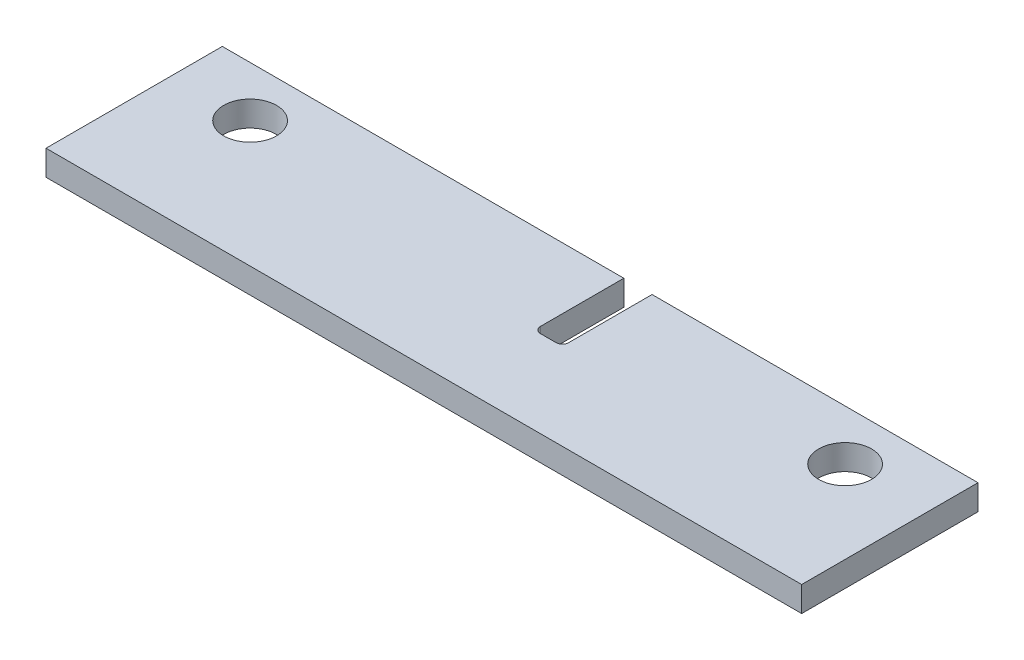
ISO-10303-21;
HEADER;
FILE_DESCRIPTION(('STEP AP214'),'2;1');
FILE_NAME('part.step','',(''),(''),'','','');
FILE_SCHEMA(('AUTOMOTIVE_DESIGN { 1 0 10303 214 1 1 1 1 }'));
ENDSEC;
DATA;
#1=APPLICATION_CONTEXT('core data for automotive mechanical design processes');
#2=APPLICATION_PROTOCOL_DEFINITION('international standard','automotive_design',2000,#1);
#3=PRODUCT_CONTEXT('',#1,'mechanical');
#4=PRODUCT('Part','Part','',(#3));
#5=PRODUCT_RELATED_PRODUCT_CATEGORY('part','',(#4));
#6=PRODUCT_DEFINITION_FORMATION('','',#4);
#7=PRODUCT_DEFINITION_CONTEXT('part definition',#1,'design');
#8=PRODUCT_DEFINITION('design','',#6,#7);
#9=PRODUCT_DEFINITION_SHAPE('','',#8);
#10=(LENGTH_UNIT() NAMED_UNIT(*) SI_UNIT(.MILLI.,.METRE.));
#11=(NAMED_UNIT(*) PLANE_ANGLE_UNIT() SI_UNIT($,.RADIAN.));
#12=(NAMED_UNIT(*) SI_UNIT($,.STERADIAN.) SOLID_ANGLE_UNIT());
#13=UNCERTAINTY_MEASURE_WITH_UNIT(LENGTH_MEASURE(1.E-05),#10,'distance_accuracy_value','');
#14=(GEOMETRIC_REPRESENTATION_CONTEXT(3) GLOBAL_UNCERTAINTY_ASSIGNED_CONTEXT((#13)) GLOBAL_UNIT_ASSIGNED_CONTEXT((#10,
#11,#12)) REPRESENTATION_CONTEXT('',''));
#15=CARTESIAN_POINT('',(0.,0.,0.));
#16=DIRECTION('',(0.,0.,1.));
#17=DIRECTION('',(1.,0.,0.));
#18=AXIS2_PLACEMENT_3D('',#15,#16,#17);
#19=CARTESIAN_POINT('',(0.,0.,249.6));
#20=DIRECTION('',(0.,0.,1.));
#21=DIRECTION('',(1.,0.,0.));
#22=AXIS2_PLACEMENT_3D('',#19,#20,#21);
#23=PLANE('',#22);
#24=DIRECTION('',(-1.,0.,0.));
#25=VECTOR('',#24,1.);
#26=CARTESIAN_POINT('',(2260.6,65.,249.6));
#27=LINE('',#26,#25);
#28=CARTESIAN_POINT('',(2463.038,65.,249.6));
#29=VERTEX_POINT('',#28);
#30=CARTESIAN_POINT('',(2260.6,65.,249.6));
#31=VERTEX_POINT('',#30);
#32=EDGE_CURVE('E117',#29,#31,#27,.T.);
#33=ORIENTED_EDGE('',*,*,#32,.F.);
#34=DIRECTION('',(0.,1.,0.));
#35=VECTOR('',#34,1.);
#36=CARTESIAN_POINT('',(2463.038,52.3,249.6));
#37=LINE('',#36,#35);
#38=CARTESIAN_POINT('',(2463.038,52.3,249.6));
#39=VERTEX_POINT('',#38);
#40=EDGE_CURVE('E171',#39,#29,#37,.T.);
#41=ORIENTED_EDGE('',*,*,#40,.F.);
#42=DIRECTION('',(1.,0.,0.));
#43=VECTOR('',#42,1.);
#44=CARTESIAN_POINT('',(2260.6,52.3,249.6));
#45=LINE('',#44,#43);
#46=CARTESIAN_POINT('',(2260.6,52.3,249.6));
#47=VERTEX_POINT('',#46);
#48=EDGE_CURVE('E140',#47,#39,#45,.T.);
#49=ORIENTED_EDGE('',*,*,#48,.F.);
#50=DIRECTION('',(0.,-1.,0.));
#51=VECTOR('',#50,1.);
#52=CARTESIAN_POINT('',(2260.6,65.,249.6));
#53=LINE('',#52,#51);
#54=EDGE_CURVE('E134',#31,#47,#53,.T.);
#55=ORIENTED_EDGE('',*,*,#54,.F.);
#56=EDGE_LOOP('',(#33,#41,#49,#55));
#57=FACE_BOUND('',#56,.T.);
#58=ADVANCED_FACE('F43',(#57),#23,.F.);
#59=CARTESIAN_POINT('',(2260.6,65.,249.6));
#60=DIRECTION('',(-1.,0.,0.));
#61=DIRECTION('',(0.,0.,1.));
#62=AXIS2_PLACEMENT_3D('',#59,#60,#61);
#63=PLANE('',#62);
#64=DIRECTION('',(0.,0.,1.));
#65=VECTOR('',#64,1.);
#66=CARTESIAN_POINT('',(2260.6,52.3,249.6));
#67=LINE('',#66,#65);
#68=CARTESIAN_POINT('',(2260.6,52.3,338.5));
#69=VERTEX_POINT('',#68);
#70=EDGE_CURVE('E142',#47,#69,#67,.T.);
#71=ORIENTED_EDGE('',*,*,#70,.T.);
#72=DIRECTION('',(0.,-1.,0.));
#73=VECTOR('',#72,1.);
#74=CARTESIAN_POINT('',(2260.6,65.,338.5));
#75=LINE('',#74,#73);
#76=CARTESIAN_POINT('',(2260.6,65.,338.5));
#77=VERTEX_POINT('',#76);
#78=EDGE_CURVE('E136',#77,#69,#75,.T.);
#79=ORIENTED_EDGE('',*,*,#78,.F.);
#80=DIRECTION('',(0.,0.,1.));
#81=VECTOR('',#80,1.);
#82=CARTESIAN_POINT('',(2260.6,65.,249.6));
#83=LINE('',#82,#81);
#84=EDGE_CURVE('E121',#31,#77,#83,.T.);
#85=ORIENTED_EDGE('',*,*,#84,.F.);
#86=ORIENTED_EDGE('',*,*,#54,.T.);
#87=EDGE_LOOP('',(#71,#79,#85,#86));
#88=FACE_BOUND('',#87,.T.);
#89=ADVANCED_FACE('F133',(#88),#63,.T.);
#90=CARTESIAN_POINT('',(2260.6,65.,249.6));
#91=DIRECTION('',(0.,1.,0.));
#92=DIRECTION('',(0.,0.,1.));
#93=AXIS2_PLACEMENT_3D('',#90,#91,#92);
#94=PLANE('',#93);
#95=CARTESIAN_POINT('',(2599.99999999996,65.,275.));
#96=DIRECTION('',(0.,1.,0.));
#97=DIRECTION('',(0.,0.,1.));
#98=AXIS2_PLACEMENT_3D('',#95,#96,#97);
#99=CIRCLE('',#98,13.3349999999999);
#100=CARTESIAN_POINT('',(2599.99999999996,64.9999999999999,261.665));
#101=VERTEX_POINT('',#100);
#102=EDGE_CURVE('E141',#101,#101,#99,.F.);
#103=ORIENTED_EDGE('',*,*,#102,.T.);
#104=EDGE_LOOP('',(#103));
#105=FACE_BOUND('',#104,.T.);
#106=CARTESIAN_POINT('',(2299.99999999996,65.,275.));
#107=DIRECTION('',(0.,1.,0.));
#108=DIRECTION('',(0.,0.,1.));
#109=AXIS2_PLACEMENT_3D('',#106,#107,#108);
#110=CIRCLE('',#109,13.3349999999999);
#111=CARTESIAN_POINT('',(2299.99999999996,65.,261.665));
#112=VERTEX_POINT('',#111);
#113=EDGE_CURVE('E127',#112,#112,#110,.F.);
#114=ORIENTED_EDGE('',*,*,#113,.T.);
#115=EDGE_LOOP('',(#114));
#116=FACE_BOUND('',#115,.T.);
#117=DIRECTION('',(0.,0.,1.));
#118=VECTOR('',#117,1.);
#119=CARTESIAN_POINT('',(2463.038,65.,249.6));
#120=LINE('',#119,#118);
#121=CARTESIAN_POINT('',(2463.038,65.,291.637));
#122=VERTEX_POINT('',#121);
#123=EDGE_CURVE('E123',#29,#122,#120,.T.);
#124=ORIENTED_EDGE('',*,*,#123,.F.);
#125=ORIENTED_EDGE('',*,*,#32,.T.);
#126=ORIENTED_EDGE('',*,*,#84,.T.);
#127=DIRECTION('',(-1.,0.,0.));
#128=VECTOR('',#127,1.);
#129=CARTESIAN_POINT('',(2260.6,65.,338.5));
#130=LINE('',#129,#128);
#131=CARTESIAN_POINT('',(2641.6,65.,338.5));
#132=VERTEX_POINT('',#131);
#133=EDGE_CURVE('E150',#132,#77,#130,.T.);
#134=ORIENTED_EDGE('',*,*,#133,.F.);
#135=DIRECTION('',(0.,0.,1.));
#136=VECTOR('',#135,1.);
#137=CARTESIAN_POINT('',(2641.6,65.,249.6));
#138=LINE('',#137,#136);
#139=CARTESIAN_POINT('',(2641.6,65.,249.6));
#140=VERTEX_POINT('',#139);
#141=EDGE_CURVE('E256',#140,#132,#138,.T.);
#142=ORIENTED_EDGE('',*,*,#141,.F.);
#143=CARTESIAN_POINT('',(2477.262,65.,249.6));
#144=VERTEX_POINT('',#143);
#145=EDGE_CURVE('E129',#140,#144,#27,.T.);
#146=ORIENTED_EDGE('',*,*,#145,.T.);
#147=DIRECTION('',(0.,0.,-1.));
#148=VECTOR('',#147,1.);
#149=CARTESIAN_POINT('',(2477.262,65.,249.6));
#150=LINE('',#149,#148);
#151=CARTESIAN_POINT('',(2477.262,65.,291.637));
#152=VERTEX_POINT('',#151);
#153=EDGE_CURVE('E173',#152,#144,#150,.T.);
#154=ORIENTED_EDGE('',*,*,#153,.F.);
#155=CARTESIAN_POINT('',(2474.087,65.,291.637));
#156=DIRECTION('',(0.,1.,0.));
#157=DIRECTION('',(0.,0.,1.));
#158=AXIS2_PLACEMENT_3D('',#155,#156,#157);
#159=CIRCLE('',#158,3.175);
#160=CARTESIAN_POINT('',(2474.087,65.,294.812));
#161=VERTEX_POINT('',#160);
#162=EDGE_CURVE('E196',#152,#161,#159,.F.);
#163=ORIENTED_EDGE('',*,*,#162,.T.);
#164=DIRECTION('',(1.,0.,0.));
#165=VECTOR('',#164,1.);
#166=CARTESIAN_POINT('',(2260.6,65.,294.812));
#167=LINE('',#166,#165);
#168=CARTESIAN_POINT('',(2466.213,65.,294.812));
#169=VERTEX_POINT('',#168);
#170=EDGE_CURVE('E184',#169,#161,#167,.T.);
#171=ORIENTED_EDGE('',*,*,#170,.F.);
#172=CARTESIAN_POINT('',(2466.213,65.,291.637));
#173=DIRECTION('',(0.,1.,0.));
#174=DIRECTION('',(0.,0.,1.));
#175=AXIS2_PLACEMENT_3D('',#172,#173,#174);
#176=CIRCLE('',#175,3.175);
#177=EDGE_CURVE('E51',#169,#122,#176,.F.);
#178=ORIENTED_EDGE('',*,*,#177,.T.);
#179=EDGE_LOOP('',(#124,#125,#126,#134,#142,#146,#154,#163,#171,#178));
#180=FACE_BOUND('',#179,.T.);
#181=ADVANCED_FACE('F119',(#105,#116,#180),#94,.T.);
#182=CARTESIAN_POINT('',(2641.6,65.,249.6));
#183=DIRECTION('',(1.,0.,0.));
#184=DIRECTION('',(0.,0.,-1.));
#185=AXIS2_PLACEMENT_3D('',#182,#183,#184);
#186=PLANE('',#185);
#187=ORIENTED_EDGE('',*,*,#141,.T.);
#188=DIRECTION('',(0.,1.,0.));
#189=VECTOR('',#188,1.);
#190=CARTESIAN_POINT('',(2641.6,65.,338.5));
#191=LINE('',#190,#189);
#192=CARTESIAN_POINT('',(2641.6,52.3,338.5));
#193=VERTEX_POINT('',#192);
#194=EDGE_CURVE('E152',#193,#132,#191,.T.);
#195=ORIENTED_EDGE('',*,*,#194,.F.);
#196=DIRECTION('',(0.,0.,1.));
#197=VECTOR('',#196,1.);
#198=CARTESIAN_POINT('',(2641.6,52.3,249.6));
#199=LINE('',#198,#197);
#200=CARTESIAN_POINT('',(2641.6,52.3,249.6));
#201=VERTEX_POINT('',#200);
#202=EDGE_CURVE('E252',#201,#193,#199,.T.);
#203=ORIENTED_EDGE('',*,*,#202,.F.);
#204=DIRECTION('',(0.,1.,0.));
#205=VECTOR('',#204,1.);
#206=CARTESIAN_POINT('',(2641.6,65.,249.6));
#207=LINE('',#206,#205);
#208=EDGE_CURVE('E164',#201,#140,#207,.T.);
#209=ORIENTED_EDGE('',*,*,#208,.T.);
#210=EDGE_LOOP('',(#187,#195,#203,#209));
#211=FACE_BOUND('',#210,.T.);
#212=ADVANCED_FACE('F245',(#211),#186,.T.);
#213=CARTESIAN_POINT('',(2260.6,52.3,249.6));
#214=DIRECTION('',(0.,-1.,0.));
#215=DIRECTION('',(0.,0.,-1.));
#216=AXIS2_PLACEMENT_3D('',#213,#214,#215);
#217=PLANE('',#216);
#218=CARTESIAN_POINT('',(2599.99999999996,52.3,275.));
#219=DIRECTION('',(0.,-1.,0.));
#220=DIRECTION('',(0.,0.,-1.));
#221=AXIS2_PLACEMENT_3D('',#218,#219,#220);
#222=CIRCLE('',#221,13.3349999999999);
#223=CARTESIAN_POINT('',(2599.99999999996,52.3,261.665));
#224=VERTEX_POINT('',#223);
#225=EDGE_CURVE('E160',#224,#224,#222,.F.);
#226=ORIENTED_EDGE('',*,*,#225,.T.);
#227=EDGE_LOOP('',(#226));
#228=FACE_BOUND('',#227,.T.);
#229=CARTESIAN_POINT('',(2299.99999999996,52.3,275.));
#230=DIRECTION('',(0.,-1.,0.));
#231=DIRECTION('',(0.,0.,-1.));
#232=AXIS2_PLACEMENT_3D('',#229,#230,#231);
#233=CIRCLE('',#232,13.3349999999999);
#234=CARTESIAN_POINT('',(2299.99999999996,52.3,261.665));
#235=VERTEX_POINT('',#234);
#236=EDGE_CURVE('E163',#235,#235,#233,.F.);
#237=ORIENTED_EDGE('',*,*,#236,.T.);
#238=EDGE_LOOP('',(#237));
#239=FACE_BOUND('',#238,.T.);
#240=DIRECTION('',(0.,0.,1.));
#241=VECTOR('',#240,1.);
#242=CARTESIAN_POINT('',(2463.038,52.3,249.6));
#243=LINE('',#242,#241);
#244=CARTESIAN_POINT('',(2463.038,52.3,291.637));
#245=VERTEX_POINT('',#244);
#246=EDGE_CURVE('E169',#39,#245,#243,.T.);
#247=ORIENTED_EDGE('',*,*,#246,.T.);
#248=CARTESIAN_POINT('',(2466.213,52.3,291.637));
#249=DIRECTION('',(0.,-1.,0.));
#250=DIRECTION('',(0.,0.,-1.));
#251=AXIS2_PLACEMENT_3D('',#248,#249,#250);
#252=CIRCLE('',#251,3.175);
#253=CARTESIAN_POINT('',(2466.213,52.3,294.812));
#254=VERTEX_POINT('',#253);
#255=EDGE_CURVE('E12',#245,#254,#252,.F.);
#256=ORIENTED_EDGE('',*,*,#255,.T.);
#257=DIRECTION('',(1.,0.,0.));
#258=VECTOR('',#257,1.);
#259=CARTESIAN_POINT('',(2463.8,52.3,294.812));
#260=LINE('',#259,#258);
#261=CARTESIAN_POINT('',(2474.087,52.3,294.812));
#262=VERTEX_POINT('',#261);
#263=EDGE_CURVE('E175',#254,#262,#260,.T.);
#264=ORIENTED_EDGE('',*,*,#263,.T.);
#265=CARTESIAN_POINT('',(2474.087,52.3,291.637));
#266=DIRECTION('',(0.,-1.,0.));
#267=DIRECTION('',(0.,0.,-1.));
#268=AXIS2_PLACEMENT_3D('',#265,#266,#267);
#269=CIRCLE('',#268,3.175);
#270=CARTESIAN_POINT('',(2477.262,52.3,291.637));
#271=VERTEX_POINT('',#270);
#272=EDGE_CURVE('E198',#262,#271,#269,.F.);
#273=ORIENTED_EDGE('',*,*,#272,.T.);
#274=DIRECTION('',(0.,0.,-1.));
#275=VECTOR('',#274,1.);
#276=CARTESIAN_POINT('',(2477.262,52.3,249.6));
#277=LINE('',#276,#275);
#278=CARTESIAN_POINT('',(2477.262,52.3,249.6));
#279=VERTEX_POINT('',#278);
#280=EDGE_CURVE('E178',#271,#279,#277,.T.);
#281=ORIENTED_EDGE('',*,*,#280,.T.);
#282=EDGE_CURVE('E180',#279,#201,#45,.T.);
#283=ORIENTED_EDGE('',*,*,#282,.T.);
#284=ORIENTED_EDGE('',*,*,#202,.T.);
#285=DIRECTION('',(1.,0.,0.));
#286=VECTOR('',#285,1.);
#287=CARTESIAN_POINT('',(2260.6,52.3,338.5));
#288=LINE('',#287,#286);
#289=EDGE_CURVE('E155',#69,#193,#288,.T.);
#290=ORIENTED_EDGE('',*,*,#289,.F.);
#291=ORIENTED_EDGE('',*,*,#70,.F.);
#292=ORIENTED_EDGE('',*,*,#48,.T.);
#293=EDGE_LOOP('',(#247,#256,#264,#273,#281,#283,#284,#290,#291,#292));
#294=FACE_BOUND('',#293,.T.);
#295=ADVANCED_FACE('F202',(#228,#239,#294),#217,.T.);
#296=ORIENTED_EDGE('',*,*,#282,.F.);
#297=DIRECTION('',(0.,1.,0.));
#298=VECTOR('',#297,1.);
#299=CARTESIAN_POINT('',(2477.262,0.,249.6));
#300=LINE('',#299,#298);
#301=EDGE_CURVE('E158',#279,#144,#300,.T.);
#302=ORIENTED_EDGE('',*,*,#301,.T.);
#303=ORIENTED_EDGE('',*,*,#145,.F.);
#304=ORIENTED_EDGE('',*,*,#208,.F.);
#305=EDGE_LOOP('',(#296,#302,#303,#304));
#306=FACE_BOUND('',#305,.T.);
#307=ADVANCED_FACE('F228',(#306),#23,.F.);
#308=CARTESIAN_POINT('',(0.,0.,338.5));
#309=DIRECTION('',(0.,0.,1.));
#310=DIRECTION('',(1.,0.,0.));
#311=AXIS2_PLACEMENT_3D('',#308,#309,#310);
#312=PLANE('',#311);
#313=ORIENTED_EDGE('',*,*,#78,.T.);
#314=ORIENTED_EDGE('',*,*,#289,.T.);
#315=ORIENTED_EDGE('',*,*,#194,.T.);
#316=ORIENTED_EDGE('',*,*,#133,.T.);
#317=EDGE_LOOP('',(#313,#314,#315,#316));
#318=FACE_BOUND('',#317,.T.);
#319=ADVANCED_FACE('F221',(#318),#312,.T.);
#320=CARTESIAN_POINT('',(2463.038,52.3,249.6));
#321=DIRECTION('',(-1.,0.,0.));
#322=DIRECTION('',(0.,0.,1.));
#323=AXIS2_PLACEMENT_3D('',#320,#321,#322);
#324=PLANE('',#323);
#325=ORIENTED_EDGE('',*,*,#123,.T.);
#326=DIRECTION('',(0.,1.,0.));
#327=VECTOR('',#326,1.);
#328=CARTESIAN_POINT('',(2463.038,52.3,291.637));
#329=LINE('',#328,#327);
#330=EDGE_CURVE('E58',#122,#245,#329,.F.);
#331=ORIENTED_EDGE('',*,*,#330,.T.);
#332=ORIENTED_EDGE('',*,*,#246,.F.);
#333=ORIENTED_EDGE('',*,*,#40,.T.);
#334=EDGE_LOOP('',(#325,#331,#332,#333));
#335=FACE_BOUND('',#334,.T.);
#336=ADVANCED_FACE('F219',(#335),#324,.F.);
#337=CARTESIAN_POINT('',(2477.262,52.3,249.6));
#338=DIRECTION('',(1.,0.,0.));
#339=DIRECTION('',(0.,0.,-1.));
#340=AXIS2_PLACEMENT_3D('',#337,#338,#339);
#341=PLANE('',#340);
#342=ORIENTED_EDGE('',*,*,#280,.F.);
#343=DIRECTION('',(0.,1.,0.));
#344=VECTOR('',#343,1.);
#345=CARTESIAN_POINT('',(2477.262,65.,291.637));
#346=LINE('',#345,#344);
#347=EDGE_CURVE('E187',#271,#152,#346,.T.);
#348=ORIENTED_EDGE('',*,*,#347,.T.);
#349=ORIENTED_EDGE('',*,*,#153,.T.);
#350=ORIENTED_EDGE('',*,*,#301,.F.);
#351=EDGE_LOOP('',(#342,#348,#349,#350));
#352=FACE_BOUND('',#351,.T.);
#353=ADVANCED_FACE('F209',(#352),#341,.F.);
#354=CARTESIAN_POINT('',(2463.8,52.3,294.812));
#355=DIRECTION('',(0.,0.,1.));
#356=DIRECTION('',(1.,0.,0.));
#357=AXIS2_PLACEMENT_3D('',#354,#355,#356);
#358=PLANE('',#357);
#359=ORIENTED_EDGE('',*,*,#170,.T.);
#360=DIRECTION('',(0.,1.,0.));
#361=VECTOR('',#360,1.);
#362=CARTESIAN_POINT('',(2474.087,52.3,294.812));
#363=LINE('',#362,#361);
#364=EDGE_CURVE('E193',#161,#262,#363,.F.);
#365=ORIENTED_EDGE('',*,*,#364,.T.);
#366=ORIENTED_EDGE('',*,*,#263,.F.);
#367=DIRECTION('',(0.,1.,0.));
#368=VECTOR('',#367,1.);
#369=CARTESIAN_POINT('',(2466.213,65.,294.812));
#370=LINE('',#369,#368);
#371=EDGE_CURVE('E190',#254,#169,#370,.T.);
#372=ORIENTED_EDGE('',*,*,#371,.T.);
#373=EDGE_LOOP('',(#359,#365,#366,#372));
#374=FACE_BOUND('',#373,.T.);
#375=ADVANCED_FACE('F215',(#374),#358,.F.);
#376=CARTESIAN_POINT('',(2299.99999999996,181.249999999996,275.));
#377=DIRECTION('',(0.,-1.,0.));
#378=DIRECTION('',(0.,0.,-1.));
#379=AXIS2_PLACEMENT_3D('',#376,#377,#378);
#380=CYLINDRICAL_SURFACE('',#379,13.3349999999999);
#381=CARTESIAN_POINT('',(2299.99999999996,65.,261.665));
#382=CARTESIAN_POINT('',(2299.99999999996,64.8677083333333,261.665));
#383=CARTESIAN_POINT('',(2299.99999999996,64.7354166666666,261.665));
#384=CARTESIAN_POINT('',(2299.99999999996,64.4708333333333,261.665));
#385=CARTESIAN_POINT('',(2299.99999999996,64.3385416666666,261.665));
#386=CARTESIAN_POINT('',(2299.99999999996,64.0739583333333,261.665));
#387=CARTESIAN_POINT('',(2299.99999999996,63.9416666666666,261.665));
#388=CARTESIAN_POINT('',(2299.99999999996,63.6770833333333,261.665));
#389=CARTESIAN_POINT('',(2299.99999999996,63.5447916666666,261.665));
#390=CARTESIAN_POINT('',(2299.99999999996,63.2802083333333,261.665));
#391=CARTESIAN_POINT('',(2299.99999999996,63.1479166666666,261.665));
#392=CARTESIAN_POINT('',(2299.99999999996,62.8833333333333,261.665));
#393=CARTESIAN_POINT('',(2299.99999999996,62.7510416666666,261.665));
#394=CARTESIAN_POINT('',(2299.99999999996,62.4864583333333,261.665));
#395=CARTESIAN_POINT('',(2299.99999999996,62.3541666666666,261.665));
#396=CARTESIAN_POINT('',(2299.99999999996,62.0895833333333,261.665));
#397=CARTESIAN_POINT('',(2299.99999999996,61.9572916666666,261.665));
#398=CARTESIAN_POINT('',(2299.99999999996,61.6927083333333,261.665));
#399=CARTESIAN_POINT('',(2299.99999999996,61.5604166666666,261.665));
#400=CARTESIAN_POINT('',(2299.99999999996,61.2958333333333,261.665));
#401=CARTESIAN_POINT('',(2299.99999999996,61.1635416666666,261.665));
#402=CARTESIAN_POINT('',(2299.99999999996,60.8989583333333,261.665));
#403=CARTESIAN_POINT('',(2299.99999999996,60.7666666666666,261.665));
#404=CARTESIAN_POINT('',(2299.99999999996,60.5020833333333,261.665));
#405=CARTESIAN_POINT('',(2299.99999999996,60.3697916666666,261.665));
#406=CARTESIAN_POINT('',(2299.99999999996,60.1052083333333,261.665));
#407=CARTESIAN_POINT('',(2299.99999999996,59.9729166666666,261.665));
#408=CARTESIAN_POINT('',(2299.99999999996,59.7083333333333,261.665));
#409=CARTESIAN_POINT('',(2299.99999999996,59.5760416666666,261.665));
#410=CARTESIAN_POINT('',(2299.99999999996,59.3114583333333,261.665));
#411=CARTESIAN_POINT('',(2299.99999999996,59.1791666666666,261.665));
#412=CARTESIAN_POINT('',(2299.99999999996,58.9145833333333,261.665));
#413=CARTESIAN_POINT('',(2299.99999999996,58.7822916666666,261.665));
#414=CARTESIAN_POINT('',(2299.99999999996,58.5177083333333,261.665));
#415=CARTESIAN_POINT('',(2299.99999999996,58.3854166666666,261.665));
#416=CARTESIAN_POINT('',(2299.99999999996,58.1208333333333,261.665));
#417=CARTESIAN_POINT('',(2299.99999999996,57.9885416666666,261.665));
#418=CARTESIAN_POINT('',(2299.99999999996,57.7239583333333,261.665));
#419=CARTESIAN_POINT('',(2299.99999999996,57.5916666666666,261.665));
#420=CARTESIAN_POINT('',(2299.99999999996,57.3270833333333,261.665));
#421=CARTESIAN_POINT('',(2299.99999999996,57.1947916666666,261.665));
#422=CARTESIAN_POINT('',(2299.99999999996,56.9302083333333,261.665));
#423=CARTESIAN_POINT('',(2299.99999999996,56.7979166666666,261.665));
#424=CARTESIAN_POINT('',(2299.99999999996,56.5333333333333,261.665));
#425=CARTESIAN_POINT('',(2299.99999999996,56.4010416666666,261.665));
#426=CARTESIAN_POINT('',(2299.99999999996,56.1364583333333,261.665));
#427=CARTESIAN_POINT('',(2299.99999999996,56.0041666666666,261.665));
#428=CARTESIAN_POINT('',(2299.99999999996,55.7395833333333,261.665));
#429=CARTESIAN_POINT('',(2299.99999999996,55.6072916666666,261.665));
#430=CARTESIAN_POINT('',(2299.99999999996,55.3427083333333,261.665));
#431=CARTESIAN_POINT('',(2299.99999999996,55.2104166666666,261.665));
#432=CARTESIAN_POINT('',(2299.99999999996,54.9458333333333,261.665));
#433=CARTESIAN_POINT('',(2299.99999999996,54.8135416666666,261.665));
#434=CARTESIAN_POINT('',(2299.99999999996,54.5489583333333,261.665));
#435=CARTESIAN_POINT('',(2299.99999999996,54.4166666666666,261.665));
#436=CARTESIAN_POINT('',(2299.99999999996,54.1520833333333,261.665));
#437=CARTESIAN_POINT('',(2299.99999999996,54.0197916666666,261.665));
#438=CARTESIAN_POINT('',(2299.99999999996,53.7552083333333,261.665));
#439=CARTESIAN_POINT('',(2299.99999999996,53.6229166666666,261.665));
#440=CARTESIAN_POINT('',(2299.99999999996,53.3583333333333,261.665));
#441=CARTESIAN_POINT('',(2299.99999999996,53.2260416666666,261.665));
#442=CARTESIAN_POINT('',(2299.99999999996,52.9614583333333,261.665));
#443=CARTESIAN_POINT('',(2299.99999999996,52.8291666666666,261.665));
#444=CARTESIAN_POINT('',(2299.99999999996,52.5645833333333,261.665));
#445=CARTESIAN_POINT('',(2299.99999999996,52.4322916666666,261.665));
#446=CARTESIAN_POINT('',(2299.99999999996,52.3,261.665));
#447=B_SPLINE_CURVE_WITH_KNOTS('',3,(#381,#382,#383,#384,#385,#386,#387,#388,#389,#390,#391,
#392,#393,#394,#395,#396,#397,#398,#399,#400,#401,#402,#403,#404,#405,#406,#407,#408,#409,#410,
#411,#412,#413,#414,#415,#416,#417,#418,#419,#420,#421,#422,#423,#424,#425,#426,#427,#428,#429,
#430,#431,#432,#433,#434,#435,#436,#437,#438,#439,#440,#441,#442,#443,#444,#445,#446),
.UNSPECIFIED.,.F.,.F.,(4,2,2,2,2,2,2,2,2,2,2,2,2,2,2,2,2,2,2,2,2,2,2,2,2,2,2,2,2,2,2,2,4),(0.,
0.396875000000005,0.793749999999996,1.190625,1.58750000000001,1.984375,2.38125,2.77812500000001,
3.17500000000001,3.571875,3.96875000000001,4.36562500000001,4.7625,5.15937500000001,
5.55625000000001,5.953125,6.35000000000001,6.74687500000001,7.14375,7.54062500000001,
7.93750000000001,8.334375,8.73125000000001,9.12812500000001,9.52500000000001,9.92187500000002,
10.31875,10.715625,11.1125,11.509375,11.90625,12.303125,12.7),.UNSPECIFIED.);
#448=EDGE_CURVE('BSEAM271',#112,#235,#447,.T.);
#449=ORIENTED_EDGE('',*,*,#113,.F.);
#450=ORIENTED_EDGE('',*,*,#236,.F.);
#451=ORIENTED_EDGE('',*,*,#448,.T.);
#452=ORIENTED_EDGE('',*,*,#448,.F.);
#453=EDGE_LOOP('',(#449,#451,#450,#452));
#454=FACE_BOUND('',#453,.T.);
#455=ADVANCED_FACE('F271',(#454),#380,.F.);
#456=CARTESIAN_POINT('',(2599.99999999996,289.999999999996,275.));
#457=DIRECTION('',(0.,-1.,0.));
#458=DIRECTION('',(0.,0.,-1.));
#459=AXIS2_PLACEMENT_3D('',#456,#457,#458);
#460=CYLINDRICAL_SURFACE('',#459,13.3349999999999);
#461=CARTESIAN_POINT('',(2599.99999999996,64.9999999999999,261.665));
#462=CARTESIAN_POINT('',(2599.99999999996,64.8677083333333,261.665));
#463=CARTESIAN_POINT('',(2599.99999999996,64.7354166666666,261.665));
#464=CARTESIAN_POINT('',(2599.99999999996,64.4708333333333,261.665));
#465=CARTESIAN_POINT('',(2599.99999999996,64.3385416666666,261.665));
#466=CARTESIAN_POINT('',(2599.99999999996,64.0739583333333,261.665));
#467=CARTESIAN_POINT('',(2599.99999999996,63.9416666666666,261.665));
#468=CARTESIAN_POINT('',(2599.99999999996,63.6770833333333,261.665));
#469=CARTESIAN_POINT('',(2599.99999999996,63.5447916666666,261.665));
#470=CARTESIAN_POINT('',(2599.99999999996,63.2802083333333,261.665));
#471=CARTESIAN_POINT('',(2599.99999999996,63.1479166666666,261.665));
#472=CARTESIAN_POINT('',(2599.99999999996,62.8833333333333,261.665));
#473=CARTESIAN_POINT('',(2599.99999999996,62.7510416666666,261.665));
#474=CARTESIAN_POINT('',(2599.99999999996,62.4864583333333,261.665));
#475=CARTESIAN_POINT('',(2599.99999999996,62.3541666666666,261.665));
#476=CARTESIAN_POINT('',(2599.99999999996,62.0895833333333,261.665));
#477=CARTESIAN_POINT('',(2599.99999999996,61.9572916666666,261.665));
#478=CARTESIAN_POINT('',(2599.99999999996,61.6927083333333,261.665));
#479=CARTESIAN_POINT('',(2599.99999999996,61.5604166666666,261.665));
#480=CARTESIAN_POINT('',(2599.99999999996,61.2958333333333,261.665));
#481=CARTESIAN_POINT('',(2599.99999999996,61.1635416666666,261.665));
#482=CARTESIAN_POINT('',(2599.99999999996,60.8989583333333,261.665));
#483=CARTESIAN_POINT('',(2599.99999999996,60.7666666666666,261.665));
#484=CARTESIAN_POINT('',(2599.99999999996,60.5020833333333,261.665));
#485=CARTESIAN_POINT('',(2599.99999999996,60.3697916666666,261.665));
#486=CARTESIAN_POINT('',(2599.99999999996,60.1052083333333,261.665));
#487=CARTESIAN_POINT('',(2599.99999999996,59.9729166666666,261.665));
#488=CARTESIAN_POINT('',(2599.99999999996,59.7083333333333,261.665));
#489=CARTESIAN_POINT('',(2599.99999999996,59.5760416666666,261.665));
#490=CARTESIAN_POINT('',(2599.99999999996,59.3114583333333,261.665));
#491=CARTESIAN_POINT('',(2599.99999999996,59.1791666666666,261.665));
#492=CARTESIAN_POINT('',(2599.99999999996,58.9145833333333,261.665));
#493=CARTESIAN_POINT('',(2599.99999999996,58.7822916666666,261.665));
#494=CARTESIAN_POINT('',(2599.99999999996,58.5177083333333,261.665));
#495=CARTESIAN_POINT('',(2599.99999999996,58.3854166666666,261.665));
#496=CARTESIAN_POINT('',(2599.99999999996,58.1208333333333,261.665));
#497=CARTESIAN_POINT('',(2599.99999999996,57.9885416666666,261.665));
#498=CARTESIAN_POINT('',(2599.99999999996,57.7239583333333,261.665));
#499=CARTESIAN_POINT('',(2599.99999999996,57.5916666666666,261.665));
#500=CARTESIAN_POINT('',(2599.99999999996,57.3270833333333,261.665));
#501=CARTESIAN_POINT('',(2599.99999999996,57.1947916666666,261.665));
#502=CARTESIAN_POINT('',(2599.99999999996,56.9302083333333,261.665));
#503=CARTESIAN_POINT('',(2599.99999999996,56.7979166666666,261.665));
#504=CARTESIAN_POINT('',(2599.99999999996,56.5333333333333,261.665));
#505=CARTESIAN_POINT('',(2599.99999999996,56.4010416666666,261.665));
#506=CARTESIAN_POINT('',(2599.99999999996,56.1364583333333,261.665));
#507=CARTESIAN_POINT('',(2599.99999999996,56.0041666666666,261.665));
#508=CARTESIAN_POINT('',(2599.99999999996,55.7395833333333,261.665));
#509=CARTESIAN_POINT('',(2599.99999999996,55.6072916666666,261.665));
#510=CARTESIAN_POINT('',(2599.99999999996,55.3427083333333,261.665));
#511=CARTESIAN_POINT('',(2599.99999999996,55.2104166666666,261.665));
#512=CARTESIAN_POINT('',(2599.99999999996,54.9458333333333,261.665));
#513=CARTESIAN_POINT('',(2599.99999999996,54.8135416666666,261.665));
#514=CARTESIAN_POINT('',(2599.99999999996,54.5489583333333,261.665));
#515=CARTESIAN_POINT('',(2599.99999999996,54.4166666666666,261.665));
#516=CARTESIAN_POINT('',(2599.99999999996,54.1520833333333,261.665));
#517=CARTESIAN_POINT('',(2599.99999999996,54.0197916666666,261.665));
#518=CARTESIAN_POINT('',(2599.99999999996,53.7552083333333,261.665));
#519=CARTESIAN_POINT('',(2599.99999999996,53.6229166666666,261.665));
#520=CARTESIAN_POINT('',(2599.99999999996,53.3583333333333,261.665));
#521=CARTESIAN_POINT('',(2599.99999999996,53.2260416666666,261.665));
#522=CARTESIAN_POINT('',(2599.99999999996,52.9614583333333,261.665));
#523=CARTESIAN_POINT('',(2599.99999999996,52.8291666666666,261.665));
#524=CARTESIAN_POINT('',(2599.99999999996,52.5645833333333,261.665));
#525=CARTESIAN_POINT('',(2599.99999999996,52.4322916666666,261.665));
#526=CARTESIAN_POINT('',(2599.99999999996,52.3,261.665));
#527=B_SPLINE_CURVE_WITH_KNOTS('',3,(#461,#462,#463,#464,#465,#466,#467,#468,#469,#470,#471,
#472,#473,#474,#475,#476,#477,#478,#479,#480,#481,#482,#483,#484,#485,#486,#487,#488,#489,#490,
#491,#492,#493,#494,#495,#496,#497,#498,#499,#500,#501,#502,#503,#504,#505,#506,#507,#508,#509,
#510,#511,#512,#513,#514,#515,#516,#517,#518,#519,#520,#521,#522,#523,#524,#525,#526),
.UNSPECIFIED.,.F.,.F.,(4,2,2,2,2,2,2,2,2,2,2,2,2,2,2,2,2,2,2,2,2,2,2,2,2,2,2,2,2,2,2,2,4),(0.,
0.396874999999991,0.79375000000001,1.190625,1.58749999999999,1.98437500000001,2.38125,
2.77812499999999,3.17499999999998,3.571875,3.96874999999999,4.36562499999998,4.7625,
5.15937499999999,5.55624999999998,5.953125,6.34999999999999,6.74687499999999,7.14375,7.540625,
7.93749999999999,8.334375,8.73125,9.12812499999999,9.52500000000001,9.921875,10.31875,10.715625,
11.1125,11.509375,11.90625,12.303125,12.7),.UNSPECIFIED.);
#528=EDGE_CURVE('BSEAM269',#101,#224,#527,.T.);
#529=ORIENTED_EDGE('',*,*,#102,.F.);
#530=ORIENTED_EDGE('',*,*,#225,.F.);
#531=ORIENTED_EDGE('',*,*,#528,.T.);
#532=ORIENTED_EDGE('',*,*,#528,.F.);
#533=EDGE_LOOP('',(#529,#531,#530,#532));
#534=FACE_BOUND('',#533,.T.);
#535=ADVANCED_FACE('F269',(#534),#460,.F.);
#536=CARTESIAN_POINT('',(2474.087,52.3,291.637));
#537=DIRECTION('',(0.,-1.,0.));
#538=DIRECTION('',(0.,0.,-1.));
#539=AXIS2_PLACEMENT_3D('',#536,#537,#538);
#540=CYLINDRICAL_SURFACE('',#539,3.175);
#541=ORIENTED_EDGE('',*,*,#272,.F.);
#542=ORIENTED_EDGE('',*,*,#364,.F.);
#543=ORIENTED_EDGE('',*,*,#162,.F.);
#544=ORIENTED_EDGE('',*,*,#347,.F.);
#545=EDGE_LOOP('',(#541,#542,#543,#544));
#546=FACE_BOUND('',#545,.T.);
#547=ADVANCED_FACE('F212',(#546),#540,.F.);
#548=CARTESIAN_POINT('',(2466.213,52.3,291.637));
#549=DIRECTION('',(0.,-1.,0.));
#550=DIRECTION('',(0.,0.,-1.));
#551=AXIS2_PLACEMENT_3D('',#548,#549,#550);
#552=CYLINDRICAL_SURFACE('',#551,3.175);
#553=ORIENTED_EDGE('',*,*,#255,.F.);
#554=ORIENTED_EDGE('',*,*,#330,.F.);
#555=ORIENTED_EDGE('',*,*,#177,.F.);
#556=ORIENTED_EDGE('',*,*,#371,.F.);
#557=EDGE_LOOP('',(#553,#554,#555,#556));
#558=FACE_BOUND('',#557,.T.);
#559=ADVANCED_FACE('F45',(#558),#552,.F.);
#560=CLOSED_SHELL('',(#58,#89,#181,#212,#295,#307,#319,#336,#353,#375,#455,#535,#547,#559));
#561=MANIFOLD_SOLID_BREP('B2',#560);
#562=ADVANCED_BREP_SHAPE_REPRESENTATION('',(#18,#561),#14);
#563=SHAPE_DEFINITION_REPRESENTATION(#9,#562);
ENDSEC;
END-ISO-10303-21;
